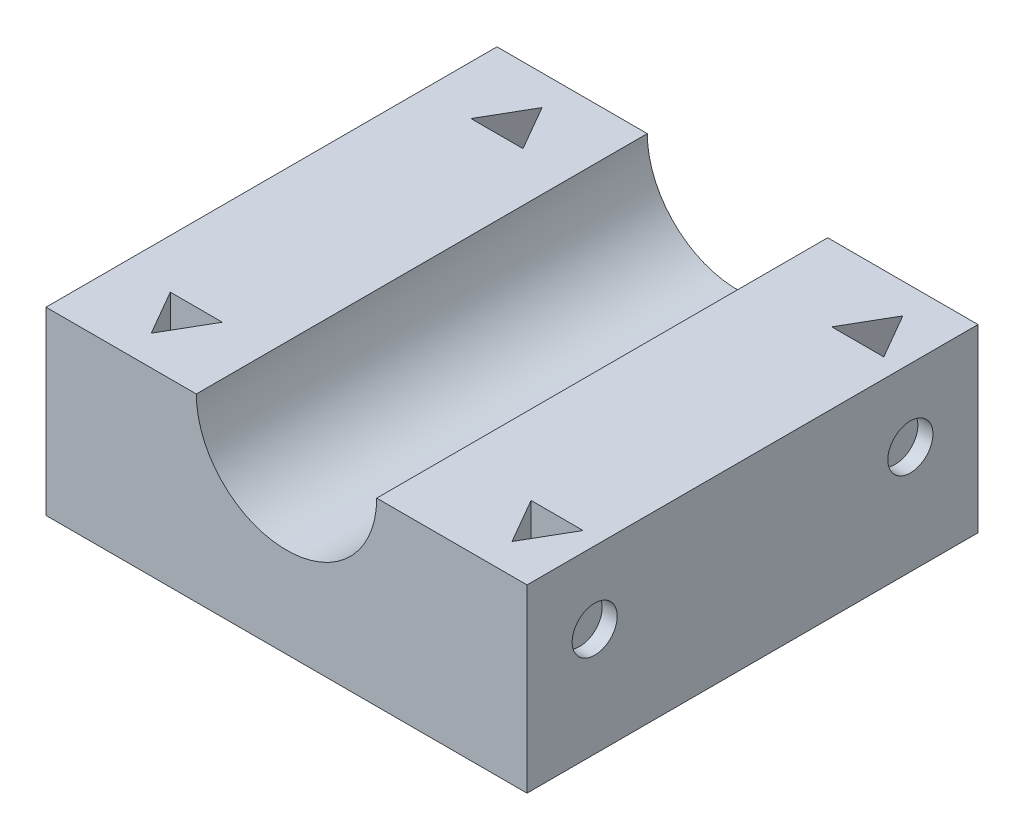
ISO-10303-21;
HEADER;
FILE_DESCRIPTION(('STEP AP214'),'2;1');
FILE_NAME('part.step','',(''),(''),'','','');
FILE_SCHEMA(('AUTOMOTIVE_DESIGN { 1 0 10303 214 1 1 1 1 }'));
ENDSEC;
DATA;
#1=APPLICATION_CONTEXT('core data for automotive mechanical design processes');
#2=APPLICATION_PROTOCOL_DEFINITION('international standard','automotive_design',2000,#1);
#3=PRODUCT_CONTEXT('',#1,'mechanical');
#4=PRODUCT('Part','Part','',(#3));
#5=PRODUCT_RELATED_PRODUCT_CATEGORY('part','',(#4));
#6=PRODUCT_DEFINITION_FORMATION('','',#4);
#7=PRODUCT_DEFINITION_CONTEXT('part definition',#1,'design');
#8=PRODUCT_DEFINITION('design','',#6,#7);
#9=PRODUCT_DEFINITION_SHAPE('','',#8);
#10=(LENGTH_UNIT() NAMED_UNIT(*) SI_UNIT(.MILLI.,.METRE.));
#11=(NAMED_UNIT(*) PLANE_ANGLE_UNIT() SI_UNIT($,.RADIAN.));
#12=(NAMED_UNIT(*) SI_UNIT($,.STERADIAN.) SOLID_ANGLE_UNIT());
#13=UNCERTAINTY_MEASURE_WITH_UNIT(LENGTH_MEASURE(1.E-05),#10,'distance_accuracy_value','');
#14=(GEOMETRIC_REPRESENTATION_CONTEXT(3) GLOBAL_UNCERTAINTY_ASSIGNED_CONTEXT((#13)) GLOBAL_UNIT_ASSIGNED_CONTEXT((#10,
#11,#12)) REPRESENTATION_CONTEXT('',''));
#15=CARTESIAN_POINT('',(0.,0.,0.));
#16=DIRECTION('',(0.,0.,1.));
#17=DIRECTION('',(1.,0.,0.));
#18=AXIS2_PLACEMENT_3D('',#15,#16,#17);
#19=CARTESIAN_POINT('',(0.,0.,30.));
#20=DIRECTION('',(0.,1.,0.));
#21=DIRECTION('',(-1.,0.,0.));
#22=AXIS2_PLACEMENT_3D('',#19,#20,#21);
#23=PLANE('',#22);
#24=DIRECTION('',(1.,0.,0.));
#25=VECTOR('',#24,1.);
#26=CARTESIAN_POINT('',(27.2679491924311,0.,5.00000000000001));
#27=LINE('',#26,#25);
#28=CARTESIAN_POINT('',(27.2679491924311,0.,5.));
#29=VERTEX_POINT('',#28);
#30=CARTESIAN_POINT('',(30.7320508075689,0.,4.99999999999998));
#31=VERTEX_POINT('',#30);
#32=EDGE_CURVE('E46',#29,#31,#27,.T.);
#33=ORIENTED_EDGE('',*,*,#32,.T.);
#34=DIRECTION('',(-0.500000000000004,0.,-0.866025403784436));
#35=VECTOR('',#34,1.);
#36=CARTESIAN_POINT('',(30.7320508075689,0.,4.99999999999998));
#37=LINE('',#36,#35);
#38=CARTESIAN_POINT('',(29.,0.,2.));
#39=VERTEX_POINT('',#38);
#40=EDGE_CURVE('E158',#31,#39,#37,.T.);
#41=ORIENTED_EDGE('',*,*,#40,.T.);
#42=DIRECTION('',(-0.499999999999998,0.,0.86602540378444));
#43=VECTOR('',#42,1.);
#44=CARTESIAN_POINT('',(29.,0.,2.));
#45=LINE('',#44,#43);
#46=EDGE_CURVE('E165',#39,#29,#45,.T.);
#47=ORIENTED_EDGE('',*,*,#46,.T.);
#48=EDGE_LOOP('',(#33,#41,#47));
#49=FACE_BOUND('',#48,.T.);
#50=DIRECTION('',(-1.,0.,0.));
#51=VECTOR('',#50,1.);
#52=CARTESIAN_POINT('',(30.7320508075689,0.,25.));
#53=LINE('',#52,#51);
#54=CARTESIAN_POINT('',(30.7320508075689,0.,25.));
#55=VERTEX_POINT('',#54);
#56=CARTESIAN_POINT('',(27.2679491924311,0.,25.));
#57=VERTEX_POINT('',#56);
#58=EDGE_CURVE('E194',#55,#57,#53,.T.);
#59=ORIENTED_EDGE('',*,*,#58,.T.);
#60=DIRECTION('',(0.500000000000004,0.,0.866025403784436));
#61=VECTOR('',#60,1.);
#62=CARTESIAN_POINT('',(27.2679491924311,0.,25.));
#63=LINE('',#62,#61);
#64=CARTESIAN_POINT('',(29.,0.,28.));
#65=VERTEX_POINT('',#64);
#66=EDGE_CURVE('E187',#57,#65,#63,.T.);
#67=ORIENTED_EDGE('',*,*,#66,.T.);
#68=DIRECTION('',(0.499999999999998,0.,-0.86602540378444));
#69=VECTOR('',#68,1.);
#70=CARTESIAN_POINT('',(29.,0.,28.));
#71=LINE('',#70,#69);
#72=EDGE_CURVE('E190',#65,#55,#71,.T.);
#73=ORIENTED_EDGE('',*,*,#72,.T.);
#74=EDGE_LOOP('',(#59,#67,#73));
#75=FACE_BOUND('',#74,.T.);
#76=DIRECTION('',(-1.,0.,0.));
#77=VECTOR('',#76,1.);
#78=CARTESIAN_POINT('',(6.73205080756892,0.,25.));
#79=LINE('',#78,#77);
#80=CARTESIAN_POINT('',(6.73205080756892,0.,25.));
#81=VERTEX_POINT('',#80);
#82=CARTESIAN_POINT('',(3.26794919243107,0.,25.));
#83=VERTEX_POINT('',#82);
#84=EDGE_CURVE('E218',#81,#83,#79,.T.);
#85=ORIENTED_EDGE('',*,*,#84,.T.);
#86=DIRECTION('',(0.5,0.,0.866025403784439));
#87=VECTOR('',#86,1.);
#88=CARTESIAN_POINT('',(3.26794919243107,0.,25.));
#89=LINE('',#88,#87);
#90=CARTESIAN_POINT('',(5.,0.,28.));
#91=VERTEX_POINT('',#90);
#92=EDGE_CURVE('E211',#83,#91,#89,.T.);
#93=ORIENTED_EDGE('',*,*,#92,.T.);
#94=DIRECTION('',(0.5,0.,-0.866025403784438));
#95=VECTOR('',#94,1.);
#96=CARTESIAN_POINT('',(5.,0.,28.));
#97=LINE('',#96,#95);
#98=EDGE_CURVE('E214',#91,#81,#97,.T.);
#99=ORIENTED_EDGE('',*,*,#98,.T.);
#100=EDGE_LOOP('',(#85,#93,#99));
#101=FACE_BOUND('',#100,.T.);
#102=DIRECTION('',(1.,0.,0.));
#103=VECTOR('',#102,1.);
#104=CARTESIAN_POINT('',(3.26794919243112,0.,5.));
#105=LINE('',#104,#103);
#106=CARTESIAN_POINT('',(3.26794919243112,0.,5.));
#107=VERTEX_POINT('',#106);
#108=CARTESIAN_POINT('',(6.73205080756888,0.,5.));
#109=VERTEX_POINT('',#108);
#110=EDGE_CURVE('E242',#107,#109,#105,.T.);
#111=ORIENTED_EDGE('',*,*,#110,.T.);
#112=DIRECTION('',(-0.5,0.,-0.866025403784438));
#113=VECTOR('',#112,1.);
#114=CARTESIAN_POINT('',(6.73205080756888,0.,5.));
#115=LINE('',#114,#113);
#116=CARTESIAN_POINT('',(5.,0.,2.));
#117=VERTEX_POINT('',#116);
#118=EDGE_CURVE('E235',#109,#117,#115,.T.);
#119=ORIENTED_EDGE('',*,*,#118,.T.);
#120=DIRECTION('',(-0.5,0.,0.866025403784438));
#121=VECTOR('',#120,1.);
#122=CARTESIAN_POINT('',(5.,0.,2.));
#123=LINE('',#122,#121);
#124=EDGE_CURVE('E238',#117,#107,#123,.T.);
#125=ORIENTED_EDGE('',*,*,#124,.T.);
#126=EDGE_LOOP('',(#111,#119,#125));
#127=FACE_BOUND('',#126,.T.);
#128=DIRECTION('',(1.,0.,0.));
#129=VECTOR('',#128,1.);
#130=CARTESIAN_POINT('',(0.,0.,0.));
#131=LINE('',#130,#129);
#132=CARTESIAN_POINT('',(0.,0.,0.));
#133=VERTEX_POINT('',#132);
#134=CARTESIAN_POINT('',(32.,0.,0.));
#135=VERTEX_POINT('',#134);
#136=EDGE_CURVE('E254',#133,#135,#131,.T.);
#137=ORIENTED_EDGE('',*,*,#136,.T.);
#138=DIRECTION('',(0.,0.,-1.));
#139=VECTOR('',#138,1.);
#140=CARTESIAN_POINT('',(32.,0.,30.));
#141=LINE('',#140,#139);
#142=CARTESIAN_POINT('',(32.,0.,30.));
#143=VERTEX_POINT('',#142);
#144=EDGE_CURVE('E11',#143,#135,#141,.T.);
#145=ORIENTED_EDGE('',*,*,#144,.F.);
#146=DIRECTION('',(1.,0.,0.));
#147=VECTOR('',#146,1.);
#148=CARTESIAN_POINT('',(0.,0.,30.));
#149=LINE('',#148,#147);
#150=CARTESIAN_POINT('',(0.,0.,30.));
#151=VERTEX_POINT('',#150);
#152=EDGE_CURVE('E259',#151,#143,#149,.T.);
#153=ORIENTED_EDGE('',*,*,#152,.F.);
#154=DIRECTION('',(0.,0.,-1.));
#155=VECTOR('',#154,1.);
#156=CARTESIAN_POINT('',(0.,0.,30.));
#157=LINE('',#156,#155);
#158=EDGE_CURVE('E273',#151,#133,#157,.T.);
#159=ORIENTED_EDGE('',*,*,#158,.T.);
#160=EDGE_LOOP('',(#137,#145,#153,#159));
#161=FACE_BOUND('',#160,.T.);
#162=ADVANCED_FACE('F32',(#49,#75,#101,#127,#161),#23,.F.);
#163=CARTESIAN_POINT('',(32.,0.,30.));
#164=DIRECTION('',(-1.,0.,0.));
#165=DIRECTION('',(0.,0.,1.));
#166=AXIS2_PLACEMENT_3D('',#163,#164,#165);
#167=PLANE('',#166);
#168=CARTESIAN_POINT('',(32.,7.2,4.5));
#169=DIRECTION('',(1.,0.,0.));
#170=DIRECTION('',(0.,0.,-1.));
#171=AXIS2_PLACEMENT_3D('',#168,#169,#170);
#172=CIRCLE('',#171,1.5);
#173=CARTESIAN_POINT('',(32.,7.2,3.));
#174=VERTEX_POINT('',#173);
#175=EDGE_CURVE('E601',#174,#174,#172,.T.);
#176=ORIENTED_EDGE('',*,*,#175,.F.);
#177=EDGE_LOOP('',(#176));
#178=FACE_BOUND('',#177,.T.);
#179=CARTESIAN_POINT('',(32.,7.2,25.5));
#180=DIRECTION('',(1.,0.,0.));
#181=DIRECTION('',(0.,0.,-1.));
#182=AXIS2_PLACEMENT_3D('',#179,#180,#181);
#183=CIRCLE('',#182,1.5);
#184=CARTESIAN_POINT('',(32.,7.2,24.));
#185=VERTEX_POINT('',#184);
#186=EDGE_CURVE('E176',#185,#185,#183,.T.);
#187=ORIENTED_EDGE('',*,*,#186,.F.);
#188=EDGE_LOOP('',(#187));
#189=FACE_BOUND('',#188,.T.);
#190=DIRECTION('',(0.,1.,0.));
#191=VECTOR('',#190,1.);
#192=CARTESIAN_POINT('',(32.,0.,0.));
#193=LINE('',#192,#191);
#194=CARTESIAN_POINT('',(32.,12.,0.));
#195=VERTEX_POINT('',#194);
#196=EDGE_CURVE('E276',#135,#195,#193,.T.);
#197=ORIENTED_EDGE('',*,*,#196,.T.);
#198=DIRECTION('',(0.,0.,-1.));
#199=VECTOR('',#198,1.);
#200=CARTESIAN_POINT('',(32.,12.,30.));
#201=LINE('',#200,#199);
#202=CARTESIAN_POINT('',(32.,12.,30.));
#203=VERTEX_POINT('',#202);
#204=EDGE_CURVE('E39',#203,#195,#201,.T.);
#205=ORIENTED_EDGE('',*,*,#204,.F.);
#206=DIRECTION('',(0.,1.,0.));
#207=VECTOR('',#206,1.);
#208=CARTESIAN_POINT('',(32.,0.,30.));
#209=LINE('',#208,#207);
#210=EDGE_CURVE('E262',#143,#203,#209,.T.);
#211=ORIENTED_EDGE('',*,*,#210,.F.);
#212=ORIENTED_EDGE('',*,*,#144,.T.);
#213=EDGE_LOOP('',(#197,#205,#211,#212));
#214=FACE_BOUND('',#213,.T.);
#215=ADVANCED_FACE('F323',(#178,#189,#214),#167,.F.);
#216=CARTESIAN_POINT('',(32.,12.,30.));
#217=DIRECTION('',(0.,-1.,0.));
#218=DIRECTION('',(1.,0.,0.));
#219=AXIS2_PLACEMENT_3D('',#216,#217,#218);
#220=PLANE('',#219);
#221=DIRECTION('',(-0.499999999999998,0.,0.86602540378444));
#222=VECTOR('',#221,1.);
#223=CARTESIAN_POINT('',(29.,12.,2.));
#224=LINE('',#223,#222);
#225=CARTESIAN_POINT('',(29.,12.,2.));
#226=VERTEX_POINT('',#225);
#227=CARTESIAN_POINT('',(27.2679491924311,12.,5.00000000000001));
#228=VERTEX_POINT('',#227);
#229=EDGE_CURVE('E173',#226,#228,#224,.T.);
#230=ORIENTED_EDGE('',*,*,#229,.F.);
#231=DIRECTION('',(-0.500000000000004,0.,-0.866025403784436));
#232=VECTOR('',#231,1.);
#233=CARTESIAN_POINT('',(30.7320508075689,12.,4.99999999999998));
#234=LINE('',#233,#232);
#235=CARTESIAN_POINT('',(30.7320508075689,12.,4.99999999999998));
#236=VERTEX_POINT('',#235);
#237=EDGE_CURVE('E54',#236,#226,#234,.T.);
#238=ORIENTED_EDGE('',*,*,#237,.F.);
#239=DIRECTION('',(1.,0.,0.));
#240=VECTOR('',#239,1.);
#241=CARTESIAN_POINT('',(27.2679491924311,12.,5.00000000000001));
#242=LINE('',#241,#240);
#243=EDGE_CURVE('E170',#228,#236,#242,.T.);
#244=ORIENTED_EDGE('',*,*,#243,.F.);
#245=EDGE_LOOP('',(#230,#238,#244));
#246=FACE_BOUND('',#245,.T.);
#247=DIRECTION('',(0.499999999999998,0.,-0.86602540378444));
#248=VECTOR('',#247,1.);
#249=CARTESIAN_POINT('',(29.,12.,28.));
#250=LINE('',#249,#248);
#251=CARTESIAN_POINT('',(29.,12.,28.));
#252=VERTEX_POINT('',#251);
#253=CARTESIAN_POINT('',(30.7320508075689,12.,25.));
#254=VERTEX_POINT('',#253);
#255=EDGE_CURVE('E199',#252,#254,#250,.T.);
#256=ORIENTED_EDGE('',*,*,#255,.F.);
#257=DIRECTION('',(0.500000000000004,0.,0.866025403784436));
#258=VECTOR('',#257,1.);
#259=CARTESIAN_POINT('',(27.2679491924311,12.,25.));
#260=LINE('',#259,#258);
#261=CARTESIAN_POINT('',(27.2679491924311,12.,25.));
#262=VERTEX_POINT('',#261);
#263=EDGE_CURVE('E185',#262,#252,#260,.T.);
#264=ORIENTED_EDGE('',*,*,#263,.F.);
#265=DIRECTION('',(-1.,0.,0.));
#266=VECTOR('',#265,1.);
#267=CARTESIAN_POINT('',(30.7320508075689,12.,25.));
#268=LINE('',#267,#266);
#269=EDGE_CURVE('E191',#254,#262,#268,.T.);
#270=ORIENTED_EDGE('',*,*,#269,.F.);
#271=EDGE_LOOP('',(#256,#264,#270));
#272=FACE_BOUND('',#271,.T.);
#273=DIRECTION('',(-1.,0.,0.));
#274=VECTOR('',#273,1.);
#275=CARTESIAN_POINT('',(32.,12.,0.));
#276=LINE('',#275,#274);
#277=CARTESIAN_POINT('',(22.,12.,0.));
#278=VERTEX_POINT('',#277);
#279=EDGE_CURVE('E278',#195,#278,#276,.T.);
#280=ORIENTED_EDGE('',*,*,#279,.T.);
#281=DIRECTION('',(0.,0.,-1.));
#282=VECTOR('',#281,1.);
#283=CARTESIAN_POINT('',(22.,12.,30.));
#284=LINE('',#283,#282);
#285=CARTESIAN_POINT('',(22.,12.,30.));
#286=VERTEX_POINT('',#285);
#287=EDGE_CURVE('E293',#286,#278,#284,.T.);
#288=ORIENTED_EDGE('',*,*,#287,.F.);
#289=DIRECTION('',(-1.,0.,0.));
#290=VECTOR('',#289,1.);
#291=CARTESIAN_POINT('',(32.,12.,30.));
#292=LINE('',#291,#290);
#293=EDGE_CURVE('E265',#203,#286,#292,.T.);
#294=ORIENTED_EDGE('',*,*,#293,.F.);
#295=ORIENTED_EDGE('',*,*,#204,.T.);
#296=EDGE_LOOP('',(#280,#288,#294,#295));
#297=FACE_BOUND('',#296,.T.);
#298=ADVANCED_FACE('F300',(#246,#272,#297),#220,.F.);
#299=CARTESIAN_POINT('',(16.,12.,30.));
#300=DIRECTION('',(0.,0.,-1.));
#301=DIRECTION('',(-1.,0.,0.));
#302=AXIS2_PLACEMENT_3D('',#299,#300,#301);
#303=CYLINDRICAL_SURFACE('',#302,6.);
#304=CARTESIAN_POINT('',(16.,12.,0.));
#305=DIRECTION('',(0.,0.,-1.));
#306=DIRECTION('',(1.,0.,0.));
#307=AXIS2_PLACEMENT_3D('',#304,#305,#306);
#308=CIRCLE('',#307,6.);
#309=CARTESIAN_POINT('',(10.,12.,0.));
#310=VERTEX_POINT('',#309);
#311=EDGE_CURVE('E280',#278,#310,#308,.T.);
#312=ORIENTED_EDGE('',*,*,#311,.T.);
#313=DIRECTION('',(0.,0.,-1.));
#314=VECTOR('',#313,1.);
#315=CARTESIAN_POINT('',(10.,12.,30.));
#316=LINE('',#315,#314);
#317=CARTESIAN_POINT('',(10.,12.,30.));
#318=VERTEX_POINT('',#317);
#319=EDGE_CURVE('E290',#318,#310,#316,.T.);
#320=ORIENTED_EDGE('',*,*,#319,.F.);
#321=CARTESIAN_POINT('',(16.,12.,30.));
#322=DIRECTION('',(0.,0.,-1.));
#323=DIRECTION('',(1.,0.,0.));
#324=AXIS2_PLACEMENT_3D('',#321,#322,#323);
#325=CIRCLE('',#324,6.);
#326=EDGE_CURVE('E267',#286,#318,#325,.T.);
#327=ORIENTED_EDGE('',*,*,#326,.F.);
#328=ORIENTED_EDGE('',*,*,#287,.T.);
#329=EDGE_LOOP('',(#312,#320,#327,#328));
#330=FACE_BOUND('',#329,.T.);
#331=ADVANCED_FACE('F311',(#330),#303,.F.);
#332=CARTESIAN_POINT('',(0.,12.,30.));
#333=DIRECTION('',(0.,-1.,0.));
#334=DIRECTION('',(0.,0.,-1.));
#335=AXIS2_PLACEMENT_3D('',#332,#333,#334);
#336=PLANE('',#335);
#337=DIRECTION('',(0.5,0.,-0.866025403784438));
#338=VECTOR('',#337,1.);
#339=CARTESIAN_POINT('',(5.,12.,28.));
#340=LINE('',#339,#338);
#341=CARTESIAN_POINT('',(5.,12.,28.));
#342=VERTEX_POINT('',#341);
#343=CARTESIAN_POINT('',(6.73205080756892,12.,25.));
#344=VERTEX_POINT('',#343);
#345=EDGE_CURVE('E223',#342,#344,#340,.T.);
#346=ORIENTED_EDGE('',*,*,#345,.F.);
#347=DIRECTION('',(0.5,0.,0.866025403784439));
#348=VECTOR('',#347,1.);
#349=CARTESIAN_POINT('',(3.26794919243107,12.,25.));
#350=LINE('',#349,#348);
#351=CARTESIAN_POINT('',(3.26794919243107,12.,25.));
#352=VERTEX_POINT('',#351);
#353=EDGE_CURVE('E206',#352,#342,#350,.T.);
#354=ORIENTED_EDGE('',*,*,#353,.F.);
#355=DIRECTION('',(-1.,0.,0.));
#356=VECTOR('',#355,1.);
#357=CARTESIAN_POINT('',(6.73205080756892,12.,25.));
#358=LINE('',#357,#356);
#359=EDGE_CURVE('E215',#344,#352,#358,.T.);
#360=ORIENTED_EDGE('',*,*,#359,.F.);
#361=EDGE_LOOP('',(#346,#354,#360));
#362=FACE_BOUND('',#361,.T.);
#363=DIRECTION('',(-0.5,0.,0.866025403784438));
#364=VECTOR('',#363,1.);
#365=CARTESIAN_POINT('',(5.,12.,2.));
#366=LINE('',#365,#364);
#367=CARTESIAN_POINT('',(5.,12.,2.));
#368=VERTEX_POINT('',#367);
#369=CARTESIAN_POINT('',(3.26794919243112,12.,5.));
#370=VERTEX_POINT('',#369);
#371=EDGE_CURVE('E247',#368,#370,#366,.T.);
#372=ORIENTED_EDGE('',*,*,#371,.F.);
#373=DIRECTION('',(-0.5,0.,-0.866025403784438));
#374=VECTOR('',#373,1.);
#375=CARTESIAN_POINT('',(6.73205080756888,12.,5.));
#376=LINE('',#375,#374);
#377=CARTESIAN_POINT('',(6.73205080756888,12.,5.));
#378=VERTEX_POINT('',#377);
#379=EDGE_CURVE('E230',#378,#368,#376,.T.);
#380=ORIENTED_EDGE('',*,*,#379,.F.);
#381=DIRECTION('',(1.,0.,0.));
#382=VECTOR('',#381,1.);
#383=CARTESIAN_POINT('',(3.26794919243112,12.,5.));
#384=LINE('',#383,#382);
#385=EDGE_CURVE('E239',#370,#378,#384,.T.);
#386=ORIENTED_EDGE('',*,*,#385,.F.);
#387=EDGE_LOOP('',(#372,#380,#386));
#388=FACE_BOUND('',#387,.T.);
#389=DIRECTION('',(-1.,0.,0.));
#390=VECTOR('',#389,1.);
#391=CARTESIAN_POINT('',(0.,12.,0.));
#392=LINE('',#391,#390);
#393=CARTESIAN_POINT('',(0.,12.,0.));
#394=VERTEX_POINT('',#393);
#395=EDGE_CURVE('E282',#310,#394,#392,.T.);
#396=ORIENTED_EDGE('',*,*,#395,.T.);
#397=DIRECTION('',(0.,0.,-1.));
#398=VECTOR('',#397,1.);
#399=CARTESIAN_POINT('',(0.,12.,30.));
#400=LINE('',#399,#398);
#401=CARTESIAN_POINT('',(0.,12.,30.));
#402=VERTEX_POINT('',#401);
#403=EDGE_CURVE('E287',#402,#394,#400,.T.);
#404=ORIENTED_EDGE('',*,*,#403,.F.);
#405=DIRECTION('',(-1.,0.,0.));
#406=VECTOR('',#405,1.);
#407=CARTESIAN_POINT('',(0.,12.,30.));
#408=LINE('',#407,#406);
#409=EDGE_CURVE('E269',#318,#402,#408,.T.);
#410=ORIENTED_EDGE('',*,*,#409,.F.);
#411=ORIENTED_EDGE('',*,*,#319,.T.);
#412=EDGE_LOOP('',(#396,#404,#410,#411));
#413=FACE_BOUND('',#412,.T.);
#414=ADVANCED_FACE('F315',(#362,#388,#413),#336,.F.);
#415=CARTESIAN_POINT('',(0.,0.,30.));
#416=DIRECTION('',(1.,0.,0.));
#417=DIRECTION('',(0.,0.,-1.));
#418=AXIS2_PLACEMENT_3D('',#415,#416,#417);
#419=PLANE('',#418);
#420=CARTESIAN_POINT('',(0.,7.66116551825746,25.5));
#421=DIRECTION('',(-1.,0.,0.));
#422=DIRECTION('',(0.,0.,1.));
#423=AXIS2_PLACEMENT_3D('',#420,#421,#422);
#424=CIRCLE('',#423,1.5);
#425=CARTESIAN_POINT('',(0.,7.66116551825746,27.));
#426=VERTEX_POINT('',#425);
#427=EDGE_CURVE('E592',#426,#426,#424,.T.);
#428=ORIENTED_EDGE('',*,*,#427,.F.);
#429=EDGE_LOOP('',(#428));
#430=FACE_BOUND('',#429,.T.);
#431=CARTESIAN_POINT('',(0.,7.66116551825746,4.5));
#432=DIRECTION('',(-1.,0.,0.));
#433=DIRECTION('',(0.,0.,1.));
#434=AXIS2_PLACEMENT_3D('',#431,#432,#433);
#435=CIRCLE('',#434,1.5);
#436=CARTESIAN_POINT('',(0.,7.66116551825746,6.));
#437=VERTEX_POINT('',#436);
#438=EDGE_CURVE('E591',#437,#437,#435,.T.);
#439=ORIENTED_EDGE('',*,*,#438,.F.);
#440=EDGE_LOOP('',(#439));
#441=FACE_BOUND('',#440,.T.);
#442=DIRECTION('',(0.,-1.,0.));
#443=VECTOR('',#442,1.);
#444=CARTESIAN_POINT('',(0.,0.,0.));
#445=LINE('',#444,#443);
#446=EDGE_CURVE('E263',#394,#133,#445,.T.);
#447=ORIENTED_EDGE('',*,*,#446,.T.);
#448=ORIENTED_EDGE('',*,*,#158,.F.);
#449=DIRECTION('',(0.,-1.,0.));
#450=VECTOR('',#449,1.);
#451=CARTESIAN_POINT('',(0.,0.,30.));
#452=LINE('',#451,#450);
#453=EDGE_CURVE('E271',#402,#151,#452,.T.);
#454=ORIENTED_EDGE('',*,*,#453,.F.);
#455=ORIENTED_EDGE('',*,*,#403,.T.);
#456=EDGE_LOOP('',(#447,#448,#454,#455));
#457=FACE_BOUND('',#456,.T.);
#458=ADVANCED_FACE('F326',(#430,#441,#457),#419,.F.);
#459=CARTESIAN_POINT('',(16.,12.,30.));
#460=DIRECTION('',(0.,0.,1.));
#461=DIRECTION('',(1.,0.,0.));
#462=AXIS2_PLACEMENT_3D('',#459,#460,#461);
#463=PLANE('',#462);
#464=ORIENTED_EDGE('',*,*,#152,.T.);
#465=ORIENTED_EDGE('',*,*,#210,.T.);
#466=ORIENTED_EDGE('',*,*,#293,.T.);
#467=ORIENTED_EDGE('',*,*,#326,.T.);
#468=ORIENTED_EDGE('',*,*,#409,.T.);
#469=ORIENTED_EDGE('',*,*,#453,.T.);
#470=EDGE_LOOP('',(#464,#465,#466,#467,#468,#469));
#471=FACE_BOUND('',#470,.T.);
#472=ADVANCED_FACE('F319',(#471),#463,.T.);
#473=CARTESIAN_POINT('',(16.,12.,0.));
#474=DIRECTION('',(0.,0.,1.));
#475=DIRECTION('',(1.,0.,0.));
#476=AXIS2_PLACEMENT_3D('',#473,#474,#475);
#477=PLANE('',#476);
#478=ORIENTED_EDGE('',*,*,#136,.F.);
#479=ORIENTED_EDGE('',*,*,#446,.F.);
#480=ORIENTED_EDGE('',*,*,#395,.F.);
#481=ORIENTED_EDGE('',*,*,#311,.F.);
#482=ORIENTED_EDGE('',*,*,#279,.F.);
#483=ORIENTED_EDGE('',*,*,#196,.F.);
#484=EDGE_LOOP('',(#478,#479,#480,#481,#482,#483));
#485=FACE_BOUND('',#484,.T.);
#486=ADVANCED_FACE('F306',(#485),#477,.F.);
#487=CARTESIAN_POINT('',(6.73205080756888,0.,5.));
#488=DIRECTION('',(0.866025403784438,0.,-0.5));
#489=DIRECTION('',(-0.5,0.,-0.866025403784438));
#490=AXIS2_PLACEMENT_3D('',#487,#488,#489);
#491=PLANE('',#490);
#492=ORIENTED_EDGE('',*,*,#379,.T.);
#493=DIRECTION('',(0.,1.,0.));
#494=VECTOR('',#493,1.);
#495=CARTESIAN_POINT('',(5.,0.,2.));
#496=LINE('',#495,#494);
#497=EDGE_CURVE('E245',#117,#368,#496,.T.);
#498=ORIENTED_EDGE('',*,*,#497,.F.);
#499=ORIENTED_EDGE('',*,*,#118,.F.);
#500=DIRECTION('',(0.,1.,0.));
#501=VECTOR('',#500,1.);
#502=CARTESIAN_POINT('',(6.73205080756888,0.,5.));
#503=LINE('',#502,#501);
#504=EDGE_CURVE('E252',#109,#378,#503,.T.);
#505=ORIENTED_EDGE('',*,*,#504,.T.);
#506=EDGE_LOOP('',(#492,#498,#499,#505));
#507=FACE_BOUND('',#506,.T.);
#508=ADVANCED_FACE('F371',(#507),#491,.F.);
#509=CARTESIAN_POINT('',(3.26794919243112,0.,5.));
#510=DIRECTION('',(0.,0.,1.));
#511=DIRECTION('',(1.,0.,0.));
#512=AXIS2_PLACEMENT_3D('',#509,#510,#511);
#513=PLANE('',#512);
#514=ORIENTED_EDGE('',*,*,#385,.T.);
#515=ORIENTED_EDGE('',*,*,#504,.F.);
#516=ORIENTED_EDGE('',*,*,#110,.F.);
#517=DIRECTION('',(0.,1.,0.));
#518=VECTOR('',#517,1.);
#519=CARTESIAN_POINT('',(3.26794919243112,0.,5.));
#520=LINE('',#519,#518);
#521=EDGE_CURVE('E255',#107,#370,#520,.T.);
#522=ORIENTED_EDGE('',*,*,#521,.T.);
#523=EDGE_LOOP('',(#514,#515,#516,#522));
#524=FACE_BOUND('',#523,.T.);
#525=ADVANCED_FACE('F376',(#524),#513,.F.);
#526=CARTESIAN_POINT('',(5.,0.,2.));
#527=DIRECTION('',(-0.866025403784439,0.,-0.5));
#528=DIRECTION('',(-0.5,0.,0.866025403784439));
#529=AXIS2_PLACEMENT_3D('',#526,#527,#528);
#530=PLANE('',#529);
#531=ORIENTED_EDGE('',*,*,#371,.T.);
#532=ORIENTED_EDGE('',*,*,#521,.F.);
#533=ORIENTED_EDGE('',*,*,#124,.F.);
#534=ORIENTED_EDGE('',*,*,#497,.T.);
#535=EDGE_LOOP('',(#531,#532,#533,#534));
#536=FACE_BOUND('',#535,.T.);
#537=ADVANCED_FACE('F388',(#536),#530,.F.);
#538=CARTESIAN_POINT('',(3.26794919243107,0.,25.));
#539=DIRECTION('',(-0.866025403784439,0.,0.5));
#540=DIRECTION('',(0.5,0.,0.866025403784439));
#541=AXIS2_PLACEMENT_3D('',#538,#539,#540);
#542=PLANE('',#541);
#543=ORIENTED_EDGE('',*,*,#353,.T.);
#544=DIRECTION('',(0.,1.,0.));
#545=VECTOR('',#544,1.);
#546=CARTESIAN_POINT('',(5.,0.,28.));
#547=LINE('',#546,#545);
#548=EDGE_CURVE('E221',#91,#342,#547,.T.);
#549=ORIENTED_EDGE('',*,*,#548,.F.);
#550=ORIENTED_EDGE('',*,*,#92,.F.);
#551=DIRECTION('',(0.,1.,0.));
#552=VECTOR('',#551,1.);
#553=CARTESIAN_POINT('',(3.26794919243107,0.,25.));
#554=LINE('',#553,#552);
#555=EDGE_CURVE('E228',#83,#352,#554,.T.);
#556=ORIENTED_EDGE('',*,*,#555,.T.);
#557=EDGE_LOOP('',(#543,#549,#550,#556));
#558=FACE_BOUND('',#557,.T.);
#559=ADVANCED_FACE('F398',(#558),#542,.F.);
#560=CARTESIAN_POINT('',(6.73205080756892,0.,25.));
#561=DIRECTION('',(0.,0.,-1.));
#562=DIRECTION('',(-1.,0.,0.));
#563=AXIS2_PLACEMENT_3D('',#560,#561,#562);
#564=PLANE('',#563);
#565=ORIENTED_EDGE('',*,*,#359,.T.);
#566=ORIENTED_EDGE('',*,*,#555,.F.);
#567=ORIENTED_EDGE('',*,*,#84,.F.);
#568=DIRECTION('',(0.,1.,0.));
#569=VECTOR('',#568,1.);
#570=CARTESIAN_POINT('',(6.73205080756892,0.,25.));
#571=LINE('',#570,#569);
#572=EDGE_CURVE('E231',#81,#344,#571,.T.);
#573=ORIENTED_EDGE('',*,*,#572,.T.);
#574=EDGE_LOOP('',(#565,#566,#567,#573));
#575=FACE_BOUND('',#574,.T.);
#576=ADVANCED_FACE('F408',(#575),#564,.F.);
#577=CARTESIAN_POINT('',(5.,0.,28.));
#578=DIRECTION('',(0.866025403784439,0.,0.5));
#579=DIRECTION('',(0.5,0.,-0.866025403784439));
#580=AXIS2_PLACEMENT_3D('',#577,#578,#579);
#581=PLANE('',#580);
#582=ORIENTED_EDGE('',*,*,#345,.T.);
#583=ORIENTED_EDGE('',*,*,#572,.F.);
#584=ORIENTED_EDGE('',*,*,#98,.F.);
#585=ORIENTED_EDGE('',*,*,#548,.T.);
#586=EDGE_LOOP('',(#582,#583,#584,#585));
#587=FACE_BOUND('',#586,.T.);
#588=ADVANCED_FACE('F418',(#587),#581,.F.);
#589=CARTESIAN_POINT('',(27.2679491924311,0.,25.));
#590=DIRECTION('',(-0.866025403784436,0.,0.500000000000004));
#591=DIRECTION('',(0.500000000000004,0.,0.866025403784436));
#592=AXIS2_PLACEMENT_3D('',#589,#590,#591);
#593=PLANE('',#592);
#594=ORIENTED_EDGE('',*,*,#263,.T.);
#595=DIRECTION('',(0.,1.,0.));
#596=VECTOR('',#595,1.);
#597=CARTESIAN_POINT('',(29.,0.,28.));
#598=LINE('',#597,#596);
#599=EDGE_CURVE('E197',#65,#252,#598,.T.);
#600=ORIENTED_EDGE('',*,*,#599,.F.);
#601=ORIENTED_EDGE('',*,*,#66,.F.);
#602=DIRECTION('',(0.,1.,0.));
#603=VECTOR('',#602,1.);
#604=CARTESIAN_POINT('',(27.2679491924311,0.,25.));
#605=LINE('',#604,#603);
#606=EDGE_CURVE('E204',#57,#262,#605,.T.);
#607=ORIENTED_EDGE('',*,*,#606,.T.);
#608=EDGE_LOOP('',(#594,#600,#601,#607));
#609=FACE_BOUND('',#608,.T.);
#610=ADVANCED_FACE('F428',(#609),#593,.F.);
#611=CARTESIAN_POINT('',(30.7320508075689,0.,25.));
#612=DIRECTION('',(0.,0.,-1.));
#613=DIRECTION('',(-1.,0.,0.));
#614=AXIS2_PLACEMENT_3D('',#611,#612,#613);
#615=PLANE('',#614);
#616=ORIENTED_EDGE('',*,*,#269,.T.);
#617=ORIENTED_EDGE('',*,*,#606,.F.);
#618=ORIENTED_EDGE('',*,*,#58,.F.);
#619=DIRECTION('',(0.,1.,0.));
#620=VECTOR('',#619,1.);
#621=CARTESIAN_POINT('',(30.7320508075689,0.,25.));
#622=LINE('',#621,#620);
#623=EDGE_CURVE('E207',#55,#254,#622,.T.);
#624=ORIENTED_EDGE('',*,*,#623,.T.);
#625=EDGE_LOOP('',(#616,#617,#618,#624));
#626=FACE_BOUND('',#625,.T.);
#627=ADVANCED_FACE('F438',(#626),#615,.F.);
#628=CARTESIAN_POINT('',(29.,0.,28.));
#629=DIRECTION('',(0.86602540378444,0.,0.499999999999998));
#630=DIRECTION('',(0.499999999999998,0.,-0.86602540378444));
#631=AXIS2_PLACEMENT_3D('',#628,#629,#630);
#632=PLANE('',#631);
#633=ORIENTED_EDGE('',*,*,#255,.T.);
#634=ORIENTED_EDGE('',*,*,#623,.F.);
#635=ORIENTED_EDGE('',*,*,#72,.F.);
#636=ORIENTED_EDGE('',*,*,#599,.T.);
#637=EDGE_LOOP('',(#633,#634,#635,#636));
#638=FACE_BOUND('',#637,.T.);
#639=ADVANCED_FACE('F448',(#638),#632,.F.);
#640=CARTESIAN_POINT('',(30.7320508075689,0.,4.99999999999998));
#641=DIRECTION('',(0.866025403784436,0.,-0.500000000000004));
#642=DIRECTION('',(-0.500000000000004,0.,-0.866025403784436));
#643=AXIS2_PLACEMENT_3D('',#640,#641,#642);
#644=PLANE('',#643);
#645=ORIENTED_EDGE('',*,*,#237,.T.);
#646=DIRECTION('',(0.,1.,0.));
#647=VECTOR('',#646,1.);
#648=CARTESIAN_POINT('',(29.,0.,2.));
#649=LINE('',#648,#647);
#650=EDGE_CURVE('E154',#39,#226,#649,.T.);
#651=ORIENTED_EDGE('',*,*,#650,.F.);
#652=ORIENTED_EDGE('',*,*,#40,.F.);
#653=DIRECTION('',(0.,1.,0.));
#654=VECTOR('',#653,1.);
#655=CARTESIAN_POINT('',(30.7320508075689,0.,4.99999999999998));
#656=LINE('',#655,#654);
#657=EDGE_CURVE('E183',#31,#236,#656,.T.);
#658=ORIENTED_EDGE('',*,*,#657,.T.);
#659=EDGE_LOOP('',(#645,#651,#652,#658));
#660=FACE_BOUND('',#659,.T.);
#661=ADVANCED_FACE('F156',(#660),#644,.F.);
#662=CARTESIAN_POINT('',(27.2679491924311,0.,5.00000000000001));
#663=DIRECTION('',(0.,0.,1.));
#664=DIRECTION('',(1.,0.,0.));
#665=AXIS2_PLACEMENT_3D('',#662,#663,#664);
#666=PLANE('',#665);
#667=ORIENTED_EDGE('',*,*,#243,.T.);
#668=ORIENTED_EDGE('',*,*,#657,.F.);
#669=ORIENTED_EDGE('',*,*,#32,.F.);
#670=DIRECTION('',(0.,1.,0.));
#671=VECTOR('',#670,1.);
#672=CARTESIAN_POINT('',(27.2679491924311,0.,5.00000000000001));
#673=LINE('',#672,#671);
#674=EDGE_CURVE('E162',#29,#228,#673,.T.);
#675=ORIENTED_EDGE('',*,*,#674,.T.);
#676=EDGE_LOOP('',(#667,#668,#669,#675));
#677=FACE_BOUND('',#676,.T.);
#678=ADVANCED_FACE('F467',(#677),#666,.F.);
#679=CARTESIAN_POINT('',(29.,0.,2.));
#680=DIRECTION('',(-0.86602540378444,0.,-0.499999999999998));
#681=DIRECTION('',(-0.499999999999998,0.,0.86602540378444));
#682=AXIS2_PLACEMENT_3D('',#679,#680,#681);
#683=PLANE('',#682);
#684=ORIENTED_EDGE('',*,*,#229,.T.);
#685=ORIENTED_EDGE('',*,*,#674,.F.);
#686=ORIENTED_EDGE('',*,*,#46,.F.);
#687=ORIENTED_EDGE('',*,*,#650,.T.);
#688=EDGE_LOOP('',(#684,#685,#686,#687));
#689=FACE_BOUND('',#688,.T.);
#690=ADVANCED_FACE('F166',(#689),#683,.F.);
#691=CARTESIAN_POINT('',(31.,7.2,25.5));
#692=DIRECTION('',(1.,0.,0.));
#693=DIRECTION('',(0.,0.,-1.));
#694=AXIS2_PLACEMENT_3D('',#691,#692,#693);
#695=CYLINDRICAL_SURFACE('',#694,1.5);
#696=CARTESIAN_POINT('',(31.,7.2,25.5));
#697=DIRECTION('',(1.,0.,0.));
#698=DIRECTION('',(0.,0.,-1.));
#699=AXIS2_PLACEMENT_3D('',#696,#697,#698);
#700=CIRCLE('',#699,1.5);
#701=CARTESIAN_POINT('',(31.,7.2,24.));
#702=VERTEX_POINT('',#701);
#703=EDGE_CURVE('E181',#702,#702,#700,.T.);
#704=ORIENTED_EDGE('',*,*,#703,.F.);
#705=EDGE_LOOP('',(#704));
#706=FACE_BOUND('',#705,.T.);
#707=ORIENTED_EDGE('',*,*,#186,.T.);
#708=EDGE_LOOP('',(#707));
#709=FACE_BOUND('',#708,.T.);
#710=ADVANCED_FACE('F483',(#706,#709),#695,.F.);
#711=CARTESIAN_POINT('',(31.,7.2,25.5));
#712=DIRECTION('',(1.,0.,0.));
#713=DIRECTION('',(0.,0.,-1.));
#714=AXIS2_PLACEMENT_3D('',#711,#712,#713);
#715=PLANE('',#714);
#716=ORIENTED_EDGE('',*,*,#703,.T.);
#717=EDGE_LOOP('',(#716));
#718=FACE_BOUND('',#717,.T.);
#719=ADVANCED_FACE('F498',(#718),#715,.T.);
#720=CARTESIAN_POINT('',(31.,7.2,4.5));
#721=DIRECTION('',(1.,0.,0.));
#722=DIRECTION('',(0.,0.,-1.));
#723=AXIS2_PLACEMENT_3D('',#720,#721,#722);
#724=CYLINDRICAL_SURFACE('',#723,1.5);
#725=CARTESIAN_POINT('',(31.,7.2,4.5));
#726=DIRECTION('',(1.,0.,0.));
#727=DIRECTION('',(0.,0.,-1.));
#728=AXIS2_PLACEMENT_3D('',#725,#726,#727);
#729=CIRCLE('',#728,1.5);
#730=CARTESIAN_POINT('',(31.,7.2,3.));
#731=VERTEX_POINT('',#730);
#732=EDGE_CURVE('E603',#731,#731,#729,.T.);
#733=ORIENTED_EDGE('',*,*,#732,.F.);
#734=EDGE_LOOP('',(#733));
#735=FACE_BOUND('',#734,.T.);
#736=ORIENTED_EDGE('',*,*,#175,.T.);
#737=EDGE_LOOP('',(#736));
#738=FACE_BOUND('',#737,.T.);
#739=ADVANCED_FACE('F508',(#735,#738),#724,.F.);
#740=CARTESIAN_POINT('',(31.,7.2,4.5));
#741=DIRECTION('',(1.,0.,0.));
#742=DIRECTION('',(0.,0.,-1.));
#743=AXIS2_PLACEMENT_3D('',#740,#741,#742);
#744=PLANE('',#743);
#745=ORIENTED_EDGE('',*,*,#732,.T.);
#746=EDGE_LOOP('',(#745));
#747=FACE_BOUND('',#746,.T.);
#748=ADVANCED_FACE('F518',(#747),#744,.T.);
#749=CARTESIAN_POINT('',(1.,7.66116551825746,4.5));
#750=DIRECTION('',(-1.,0.,0.));
#751=DIRECTION('',(0.,0.,1.));
#752=AXIS2_PLACEMENT_3D('',#749,#750,#751);
#753=CYLINDRICAL_SURFACE('',#752,1.5);
#754=CARTESIAN_POINT('',(1.,7.66116551825746,4.5));
#755=DIRECTION('',(-1.,0.,0.));
#756=DIRECTION('',(0.,0.,1.));
#757=AXIS2_PLACEMENT_3D('',#754,#755,#756);
#758=CIRCLE('',#757,1.5);
#759=CARTESIAN_POINT('',(1.,7.66116551825746,6.));
#760=VERTEX_POINT('',#759);
#761=EDGE_CURVE('E595',#760,#760,#758,.T.);
#762=ORIENTED_EDGE('',*,*,#761,.F.);
#763=EDGE_LOOP('',(#762));
#764=FACE_BOUND('',#763,.T.);
#765=ORIENTED_EDGE('',*,*,#438,.T.);
#766=EDGE_LOOP('',(#765));
#767=FACE_BOUND('',#766,.T.);
#768=ADVANCED_FACE('F527',(#764,#767),#753,.F.);
#769=CARTESIAN_POINT('',(1.,7.66116551825746,4.5));
#770=DIRECTION('',(-1.,0.,0.));
#771=DIRECTION('',(0.,0.,1.));
#772=AXIS2_PLACEMENT_3D('',#769,#770,#771);
#773=PLANE('',#772);
#774=ORIENTED_EDGE('',*,*,#761,.T.);
#775=EDGE_LOOP('',(#774));
#776=FACE_BOUND('',#775,.T.);
#777=ADVANCED_FACE('F542',(#776),#773,.T.);
#778=CARTESIAN_POINT('',(1.,7.66116551825746,25.5));
#779=DIRECTION('',(-1.,0.,0.));
#780=DIRECTION('',(0.,0.,1.));
#781=AXIS2_PLACEMENT_3D('',#778,#779,#780);
#782=CYLINDRICAL_SURFACE('',#781,1.5);
#783=CARTESIAN_POINT('',(1.,7.66116551825746,25.5));
#784=DIRECTION('',(-1.,0.,0.));
#785=DIRECTION('',(0.,0.,1.));
#786=AXIS2_PLACEMENT_3D('',#783,#784,#785);
#787=CIRCLE('',#786,1.5);
#788=CARTESIAN_POINT('',(1.,7.66116551825746,27.));
#789=VERTEX_POINT('',#788);
#790=EDGE_CURVE('E590',#789,#789,#787,.T.);
#791=ORIENTED_EDGE('',*,*,#790,.F.);
#792=EDGE_LOOP('',(#791));
#793=FACE_BOUND('',#792,.T.);
#794=ORIENTED_EDGE('',*,*,#427,.T.);
#795=EDGE_LOOP('',(#794));
#796=FACE_BOUND('',#795,.T.);
#797=ADVANCED_FACE('F552',(#793,#796),#782,.F.);
#798=CARTESIAN_POINT('',(1.,7.66116551825746,25.5));
#799=DIRECTION('',(-1.,0.,0.));
#800=DIRECTION('',(0.,0.,1.));
#801=AXIS2_PLACEMENT_3D('',#798,#799,#800);
#802=PLANE('',#801);
#803=ORIENTED_EDGE('',*,*,#790,.T.);
#804=EDGE_LOOP('',(#803));
#805=FACE_BOUND('',#804,.T.);
#806=ADVANCED_FACE('F562',(#805),#802,.T.);
#807=CLOSED_SHELL('',(#162,#215,#298,#331,#414,#458,#472,#486,#508,#525,#537,#559,#576,#588,
#610,#627,#639,#661,#678,#690,#710,#719,#739,#748,#768,#777,#797,#806));
#808=MANIFOLD_SOLID_BREP('B2',#807);
#809=ADVANCED_BREP_SHAPE_REPRESENTATION('',(#18,#808),#14);
#810=SHAPE_DEFINITION_REPRESENTATION(#9,#809);
ENDSEC;
END-ISO-10303-21;
